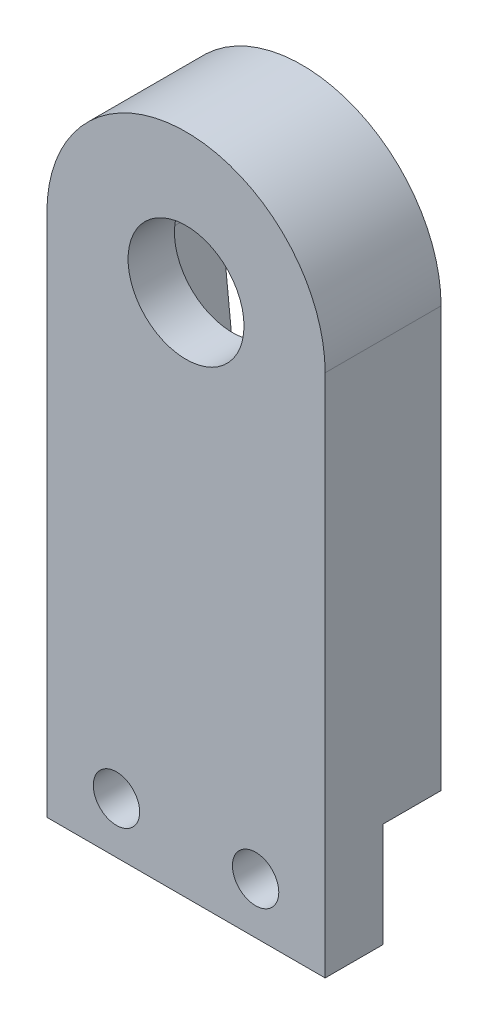
ISO-10303-21;
HEADER;
FILE_DESCRIPTION(('STEP AP214'),'2;1');
FILE_NAME('part.step','',(''),(''),'','','');
FILE_SCHEMA(('AUTOMOTIVE_DESIGN { 1 0 10303 214 1 1 1 1 }'));
ENDSEC;
DATA;
#1=APPLICATION_CONTEXT('core data for automotive mechanical design processes');
#2=APPLICATION_PROTOCOL_DEFINITION('international standard','automotive_design',2000,#1);
#3=PRODUCT_CONTEXT('',#1,'mechanical');
#4=PRODUCT('Part','Part','',(#3));
#5=PRODUCT_RELATED_PRODUCT_CATEGORY('part','',(#4));
#6=PRODUCT_DEFINITION_FORMATION('','',#4);
#7=PRODUCT_DEFINITION_CONTEXT('part definition',#1,'design');
#8=PRODUCT_DEFINITION('design','',#6,#7);
#9=PRODUCT_DEFINITION_SHAPE('','',#8);
#10=(LENGTH_UNIT() NAMED_UNIT(*) SI_UNIT(.MILLI.,.METRE.));
#11=(NAMED_UNIT(*) PLANE_ANGLE_UNIT() SI_UNIT($,.RADIAN.));
#12=(NAMED_UNIT(*) SI_UNIT($,.STERADIAN.) SOLID_ANGLE_UNIT());
#13=UNCERTAINTY_MEASURE_WITH_UNIT(LENGTH_MEASURE(1.E-05),#10,'distance_accuracy_value','');
#14=(GEOMETRIC_REPRESENTATION_CONTEXT(3) GLOBAL_UNCERTAINTY_ASSIGNED_CONTEXT((#13)) GLOBAL_UNIT_ASSIGNED_CONTEXT((#10,
#11,#12)) REPRESENTATION_CONTEXT('',''));
#15=CARTESIAN_POINT('',(0.,0.,0.));
#16=DIRECTION('',(0.,0.,1.));
#17=DIRECTION('',(1.,0.,0.));
#18=AXIS2_PLACEMENT_3D('',#15,#16,#17);
#19=CARTESIAN_POINT('',(0.,0.,0.));
#20=DIRECTION('',(0.,0.,1.));
#21=DIRECTION('',(1.,0.,0.));
#22=AXIS2_PLACEMENT_3D('',#19,#20,#21);
#23=PLANE('',#22);
#24=CARTESIAN_POINT('',(-37.4293830245733,302.993476390839,0.));
#25=DIRECTION('',(0.,0.,1.));
#26=DIRECTION('',(1.,0.,0.));
#27=AXIS2_PLACEMENT_3D('',#24,#25,#26);
#28=CIRCLE('',#27,3.6209952068518);
#29=CARTESIAN_POINT('',(-33.809082582593,303.064405918121,0.));
#30=VERTEX_POINT('',#29);
#31=CARTESIAN_POINT('',(-40.9619695672962,302.198216303687,0.));
#32=VERTEX_POINT('',#31);
#33=EDGE_CURVE('E57',#30,#32,#28,.T.);
#34=ORIENTED_EDGE('',*,*,#33,.T.);
#35=DIRECTION('',(0.102495598114495,-0.994733457950999,0.));
#36=VECTOR('',#35,1.);
#37=CARTESIAN_POINT('',(-40.9619695672962,302.198216303687,0.));
#38=LINE('',#37,#36);
#39=CARTESIAN_POINT('',(-39.5671986043453,288.661777973175,0.));
#40=VERTEX_POINT('',#39);
#41=EDGE_CURVE('E155',#32,#40,#38,.T.);
#42=ORIENTED_EDGE('',*,*,#41,.T.);
#43=CARTESIAN_POINT('',(-37.4293811619282,288.881826289682,0.));
#44=DIRECTION('',(0.,0.,-1.));
#45=DIRECTION('',(-1.,0.,0.));
#46=AXIS2_PLACEMENT_3D('',#43,#44,#45);
#47=CIRCLE('',#46,2.14911253281451);
#48=CARTESIAN_POINT('',(-35.291563719511,288.661777973175,0.));
#49=VERTEX_POINT('',#48);
#50=EDGE_CURVE('E158',#49,#40,#47,.T.);
#51=ORIENTED_EDGE('',*,*,#50,.F.);
#52=DIRECTION('',(-0.102390318397392,-0.99474430015883,0.));
#53=VECTOR('',#52,1.);
#54=CARTESIAN_POINT('',(-33.809082582593,303.064405918121,0.));
#55=LINE('',#54,#53);
#56=EDGE_CURVE('E145',#30,#49,#55,.T.);
#57=ORIENTED_EDGE('',*,*,#56,.F.);
#58=EDGE_LOOP('',(#34,#42,#51,#57));
#59=FACE_BOUND('',#58,.T.);
#60=DIRECTION('',(-1.,0.,0.));
#61=VECTOR('',#60,1.);
#62=CARTESIAN_POINT('',(-31.4293839037418,284.888430272738,0.));
#63=LINE('',#62,#61);
#64=CARTESIAN_POINT('',(-31.4293839037418,284.888430272738,0.));
#65=VERTEX_POINT('',#64);
#66=CARTESIAN_POINT('',(-43.4293821454048,284.888430272738,0.));
#67=VERTEX_POINT('',#66);
#68=EDGE_CURVE('E122',#65,#67,#63,.T.);
#69=ORIENTED_EDGE('',*,*,#68,.T.);
#70=DIRECTION('',(0.,-1.,0.));
#71=VECTOR('',#70,1.);
#72=CARTESIAN_POINT('',(-43.4293821454048,280.388430272738,0.));
#73=LINE('',#72,#71);
#74=CARTESIAN_POINT('',(-43.4293821454048,302.993476390839,0.));
#75=VERTEX_POINT('',#74);
#76=EDGE_CURVE('E184',#75,#67,#73,.T.);
#77=ORIENTED_EDGE('',*,*,#76,.F.);
#78=CARTESIAN_POINT('',(-37.4293830245733,302.993476390839,0.));
#79=DIRECTION('',(0.,0.,1.));
#80=DIRECTION('',(1.,0.,0.));
#81=AXIS2_PLACEMENT_3D('',#78,#79,#80);
#82=CIRCLE('',#81,5.99999912083149);
#83=CARTESIAN_POINT('',(-31.4293839037418,302.993476390839,0.));
#84=VERTEX_POINT('',#83);
#85=EDGE_CURVE('E174',#84,#75,#82,.T.);
#86=ORIENTED_EDGE('',*,*,#85,.F.);
#87=DIRECTION('',(0.,1.,0.));
#88=VECTOR('',#87,1.);
#89=CARTESIAN_POINT('',(-31.4293839037418,280.388430272738,0.));
#90=LINE('',#89,#88);
#91=EDGE_CURVE('E178',#65,#84,#90,.T.);
#92=ORIENTED_EDGE('',*,*,#91,.F.);
#93=EDGE_LOOP('',(#69,#77,#86,#92));
#94=FACE_BOUND('',#93,.T.);
#95=ADVANCED_FACE('F32',(#59,#94),#23,.F.);
#96=CARTESIAN_POINT('',(-31.4293839037418,280.388430272738,5.));
#97=DIRECTION('',(-1.,0.,0.));
#98=DIRECTION('',(0.,0.,1.));
#99=AXIS2_PLACEMENT_3D('',#96,#97,#98);
#100=PLANE('',#99);
#101=DIRECTION('',(0.,0.,-1.));
#102=VECTOR('',#101,1.);
#103=CARTESIAN_POINT('',(-31.4293839037418,284.888430272738,2.5));
#104=LINE('',#103,#102);
#105=CARTESIAN_POINT('',(-31.4293839037418,284.888430272738,2.5));
#106=VERTEX_POINT('',#105);
#107=EDGE_CURVE('E119',#106,#65,#104,.T.);
#108=ORIENTED_EDGE('',*,*,#107,.T.);
#109=ORIENTED_EDGE('',*,*,#91,.T.);
#110=DIRECTION('',(0.,0.,-1.));
#111=VECTOR('',#110,1.);
#112=CARTESIAN_POINT('',(-31.4293839037418,302.993476390839,5.));
#113=LINE('',#112,#111);
#114=CARTESIAN_POINT('',(-31.4293839037418,302.993476390839,5.));
#115=VERTEX_POINT('',#114);
#116=EDGE_CURVE('E11',#115,#84,#113,.T.);
#117=ORIENTED_EDGE('',*,*,#116,.F.);
#118=DIRECTION('',(0.,1.,0.));
#119=VECTOR('',#118,1.);
#120=CARTESIAN_POINT('',(-31.4293839037418,280.388430272738,5.));
#121=LINE('',#120,#119);
#122=CARTESIAN_POINT('',(-31.4293839037418,280.388430272738,5.));
#123=VERTEX_POINT('',#122);
#124=EDGE_CURVE('E181',#123,#115,#121,.T.);
#125=ORIENTED_EDGE('',*,*,#124,.F.);
#126=DIRECTION('',(0.,0.,-1.));
#127=VECTOR('',#126,1.);
#128=CARTESIAN_POINT('',(-31.4293839037418,280.388430272738,5.));
#129=LINE('',#128,#127);
#130=CARTESIAN_POINT('',(-31.4293839037418,280.388430272738,2.5));
#131=VERTEX_POINT('',#130);
#132=EDGE_CURVE('E130',#123,#131,#129,.T.);
#133=ORIENTED_EDGE('',*,*,#132,.T.);
#134=DIRECTION('',(0.,1.,0.));
#135=VECTOR('',#134,1.);
#136=CARTESIAN_POINT('',(-31.4293839037418,280.388430272738,2.5));
#137=LINE('',#136,#135);
#138=EDGE_CURVE('E49',#131,#106,#137,.T.);
#139=ORIENTED_EDGE('',*,*,#138,.T.);
#140=EDGE_LOOP('',(#108,#109,#117,#125,#133,#139));
#141=FACE_BOUND('',#140,.T.);
#142=ADVANCED_FACE('F34',(#141),#100,.F.);
#143=CARTESIAN_POINT('',(-43.4293821454048,280.388430272738,5.));
#144=DIRECTION('',(1.,0.,0.));
#145=DIRECTION('',(0.,0.,-1.));
#146=AXIS2_PLACEMENT_3D('',#143,#144,#145);
#147=PLANE('',#146);
#148=DIRECTION('',(0.,0.,-1.));
#149=VECTOR('',#148,1.);
#150=CARTESIAN_POINT('',(-43.4293821454048,284.888430272738,2.5));
#151=LINE('',#150,#149);
#152=CARTESIAN_POINT('',(-43.4293821454048,284.888430272738,2.5));
#153=VERTEX_POINT('',#152);
#154=EDGE_CURVE('E125',#153,#67,#151,.T.);
#155=ORIENTED_EDGE('',*,*,#154,.F.);
#156=DIRECTION('',(0.,1.,0.));
#157=VECTOR('',#156,1.);
#158=CARTESIAN_POINT('',(-43.4293821454048,280.388430272738,2.5));
#159=LINE('',#158,#157);
#160=CARTESIAN_POINT('',(-43.4293821454048,280.388430272738,2.5));
#161=VERTEX_POINT('',#160);
#162=EDGE_CURVE('E114',#161,#153,#159,.T.);
#163=ORIENTED_EDGE('',*,*,#162,.F.);
#164=DIRECTION('',(0.,0.,-1.));
#165=VECTOR('',#164,1.);
#166=CARTESIAN_POINT('',(-43.4293821454048,280.388430272738,5.));
#167=LINE('',#166,#165);
#168=CARTESIAN_POINT('',(-43.4293821454048,280.388430272738,5.));
#169=VERTEX_POINT('',#168);
#170=EDGE_CURVE('E192',#169,#161,#167,.T.);
#171=ORIENTED_EDGE('',*,*,#170,.F.);
#172=DIRECTION('',(0.,-1.,0.));
#173=VECTOR('',#172,1.);
#174=CARTESIAN_POINT('',(-43.4293821454048,280.388430272738,5.));
#175=LINE('',#174,#173);
#176=CARTESIAN_POINT('',(-43.4293821454048,302.993476390839,5.));
#177=VERTEX_POINT('',#176);
#178=EDGE_CURVE('E183',#177,#169,#175,.T.);
#179=ORIENTED_EDGE('',*,*,#178,.F.);
#180=DIRECTION('',(0.,0.,-1.));
#181=VECTOR('',#180,1.);
#182=CARTESIAN_POINT('',(-43.4293821454048,302.993476390839,5.));
#183=LINE('',#182,#181);
#184=EDGE_CURVE('E41',#177,#75,#183,.T.);
#185=ORIENTED_EDGE('',*,*,#184,.T.);
#186=ORIENTED_EDGE('',*,*,#76,.T.);
#187=EDGE_LOOP('',(#155,#163,#171,#179,#185,#186));
#188=FACE_BOUND('',#187,.T.);
#189=ADVANCED_FACE('F228',(#188),#147,.F.);
#190=CARTESIAN_POINT('',(-31.4293839037418,280.388430272738,5.));
#191=DIRECTION('',(0.,1.,0.));
#192=DIRECTION('',(0.,0.,1.));
#193=AXIS2_PLACEMENT_3D('',#190,#191,#192);
#194=PLANE('',#193);
#195=ORIENTED_EDGE('',*,*,#170,.T.);
#196=DIRECTION('',(-1.,0.,0.));
#197=VECTOR('',#196,1.);
#198=CARTESIAN_POINT('',(-31.4293839037418,280.388430272738,2.5));
#199=LINE('',#198,#197);
#200=EDGE_CURVE('E138',#131,#161,#199,.T.);
#201=ORIENTED_EDGE('',*,*,#200,.F.);
#202=ORIENTED_EDGE('',*,*,#132,.F.);
#203=DIRECTION('',(1.,0.,0.));
#204=VECTOR('',#203,1.);
#205=CARTESIAN_POINT('',(-31.4293839037418,280.388430272738,5.));
#206=LINE('',#205,#204);
#207=EDGE_CURVE('E186',#169,#123,#206,.T.);
#208=ORIENTED_EDGE('',*,*,#207,.F.);
#209=EDGE_LOOP('',(#195,#201,#202,#208));
#210=FACE_BOUND('',#209,.T.);
#211=ADVANCED_FACE('F216',(#210),#194,.F.);
#212=CARTESIAN_POINT('',(0.,0.,5.));
#213=DIRECTION('',(0.,0.,1.));
#214=DIRECTION('',(1.,0.,0.));
#215=AXIS2_PLACEMENT_3D('',#212,#213,#214);
#216=PLANE('',#215);
#217=CARTESIAN_POINT('',(-34.4293839037418,282.588430272738,5.));
#218=DIRECTION('',(0.,0.,1.));
#219=DIRECTION('',(1.,0.,0.));
#220=AXIS2_PLACEMENT_3D('',#217,#218,#219);
#221=CIRCLE('',#220,0.999999999999998);
#222=CARTESIAN_POINT('',(-33.4293839037418,282.588430272738,5.));
#223=VERTEX_POINT('',#222);
#224=EDGE_CURVE('E200',#223,#223,#221,.T.);
#225=ORIENTED_EDGE('',*,*,#224,.F.);
#226=EDGE_LOOP('',(#225));
#227=FACE_BOUND('',#226,.T.);
#228=CARTESIAN_POINT('',(-40.4293821454048,282.588430272738,5.));
#229=DIRECTION('',(0.,0.,1.));
#230=DIRECTION('',(1.,0.,0.));
#231=AXIS2_PLACEMENT_3D('',#228,#229,#230);
#232=CIRCLE('',#231,0.999999999999998);
#233=CARTESIAN_POINT('',(-39.4293821454048,282.588430272738,5.));
#234=VERTEX_POINT('',#233);
#235=EDGE_CURVE('E134',#234,#234,#232,.T.);
#236=ORIENTED_EDGE('',*,*,#235,.F.);
#237=EDGE_LOOP('',(#236));
#238=FACE_BOUND('',#237,.T.);
#239=CARTESIAN_POINT('',(-37.4293830245733,302.993476390839,5.));
#240=DIRECTION('',(0.,0.,1.));
#241=DIRECTION('',(1.,0.,0.));
#242=AXIS2_PLACEMENT_3D('',#239,#240,#241);
#243=CIRCLE('',#242,2.5);
#244=CARTESIAN_POINT('',(-34.9293830245733,302.993476390839,5.));
#245=VERTEX_POINT('',#244);
#246=EDGE_CURVE('E171',#245,#245,#243,.T.);
#247=ORIENTED_EDGE('',*,*,#246,.F.);
#248=EDGE_LOOP('',(#247));
#249=FACE_BOUND('',#248,.T.);
#250=ORIENTED_EDGE('',*,*,#124,.T.);
#251=CARTESIAN_POINT('',(-37.4293830245733,302.993476390839,5.));
#252=DIRECTION('',(0.,0.,1.));
#253=DIRECTION('',(1.,0.,0.));
#254=AXIS2_PLACEMENT_3D('',#251,#252,#253);
#255=CIRCLE('',#254,5.99999912083149);
#256=EDGE_CURVE('E175',#115,#177,#255,.T.);
#257=ORIENTED_EDGE('',*,*,#256,.T.);
#258=ORIENTED_EDGE('',*,*,#178,.T.);
#259=ORIENTED_EDGE('',*,*,#207,.T.);
#260=EDGE_LOOP('',(#250,#257,#258,#259));
#261=FACE_BOUND('',#260,.T.);
#262=ADVANCED_FACE('F212',(#227,#238,#249,#261),#216,.T.);
#263=CARTESIAN_POINT('',(-37.4293830245733,302.993476390839,5.));
#264=DIRECTION('',(0.,0.,-1.));
#265=DIRECTION('',(-1.,0.,0.));
#266=AXIS2_PLACEMENT_3D('',#263,#264,#265);
#267=CYLINDRICAL_SURFACE('',#266,5.99999912083149);
#268=ORIENTED_EDGE('',*,*,#85,.T.);
#269=ORIENTED_EDGE('',*,*,#184,.F.);
#270=ORIENTED_EDGE('',*,*,#256,.F.);
#271=ORIENTED_EDGE('',*,*,#116,.T.);
#272=EDGE_LOOP('',(#268,#269,#270,#271));
#273=FACE_BOUND('',#272,.T.);
#274=ADVANCED_FACE('F215',(#273),#267,.T.);
#275=CARTESIAN_POINT('',(-37.4293830245733,302.993476390839,5.));
#276=DIRECTION('',(0.,0.,-1.));
#277=DIRECTION('',(-1.,0.,0.));
#278=AXIS2_PLACEMENT_3D('',#275,#276,#277);
#279=CYLINDRICAL_SURFACE('',#278,2.5);
#280=CARTESIAN_POINT('',(-37.4293830245733,302.993476390839,3.));
#281=DIRECTION('',(0.,0.,1.));
#282=DIRECTION('',(1.,0.,0.));
#283=AXIS2_PLACEMENT_3D('',#280,#281,#282);
#284=CIRCLE('',#283,2.5);
#285=CARTESIAN_POINT('',(-34.9293830245733,302.993476390839,3.));
#286=VERTEX_POINT('',#285);
#287=EDGE_CURVE('E170',#286,#286,#284,.T.);
#288=ORIENTED_EDGE('',*,*,#287,.F.);
#289=EDGE_LOOP('',(#288));
#290=FACE_BOUND('',#289,.T.);
#291=ORIENTED_EDGE('',*,*,#246,.T.);
#292=EDGE_LOOP('',(#291));
#293=FACE_BOUND('',#292,.T.);
#294=ADVANCED_FACE('F246',(#290,#293),#279,.F.);
#295=CARTESIAN_POINT('',(-37.4293830245733,302.993476390839,3.));
#296=DIRECTION('',(0.,0.,-1.));
#297=DIRECTION('',(-1.,0.,0.));
#298=AXIS2_PLACEMENT_3D('',#295,#296,#297);
#299=CYLINDRICAL_SURFACE('',#298,3.6209952068518);
#300=ORIENTED_EDGE('',*,*,#33,.F.);
#301=DIRECTION('',(0.,0.,-1.));
#302=VECTOR('',#301,1.);
#303=CARTESIAN_POINT('',(-33.809082582593,303.064405918121,3.));
#304=LINE('',#303,#302);
#305=CARTESIAN_POINT('',(-33.809082582593,303.064405918121,3.));
#306=VERTEX_POINT('',#305);
#307=EDGE_CURVE('E153',#306,#30,#304,.T.);
#308=ORIENTED_EDGE('',*,*,#307,.F.);
#309=CARTESIAN_POINT('',(-37.4293830245733,302.993476390839,3.));
#310=DIRECTION('',(0.,0.,1.));
#311=DIRECTION('',(1.,0.,0.));
#312=AXIS2_PLACEMENT_3D('',#309,#310,#311);
#313=CIRCLE('',#312,3.6209952068518);
#314=CARTESIAN_POINT('',(-40.9619695672962,302.198216303687,3.));
#315=VERTEX_POINT('',#314);
#316=EDGE_CURVE('E141',#306,#315,#313,.T.);
#317=ORIENTED_EDGE('',*,*,#316,.T.);
#318=DIRECTION('',(0.,0.,-1.));
#319=VECTOR('',#318,1.);
#320=CARTESIAN_POINT('',(-40.9619695672962,302.198216303687,3.));
#321=LINE('',#320,#319);
#322=EDGE_CURVE('E168',#315,#32,#321,.T.);
#323=ORIENTED_EDGE('',*,*,#322,.T.);
#324=EDGE_LOOP('',(#300,#308,#317,#323));
#325=FACE_BOUND('',#324,.T.);
#326=ADVANCED_FACE('F249',(#325),#299,.F.);
#327=CARTESIAN_POINT('',(-40.9619695672962,302.198216303687,3.));
#328=DIRECTION('',(0.994733457950999,0.102495598114495,0.));
#329=DIRECTION('',(-0.102495598114495,0.994733457950999,0.));
#330=AXIS2_PLACEMENT_3D('',#327,#328,#329);
#331=PLANE('',#330);
#332=ORIENTED_EDGE('',*,*,#41,.F.);
#333=ORIENTED_EDGE('',*,*,#322,.F.);
#334=DIRECTION('',(0.102495598114495,-0.994733457950999,0.));
#335=VECTOR('',#334,1.);
#336=CARTESIAN_POINT('',(-40.9619695672962,302.198216303687,3.));
#337=LINE('',#336,#335);
#338=CARTESIAN_POINT('',(-39.5671986043453,288.661777973175,3.));
#339=VERTEX_POINT('',#338);
#340=EDGE_CURVE('E144',#315,#339,#337,.T.);
#341=ORIENTED_EDGE('',*,*,#340,.T.);
#342=DIRECTION('',(0.,0.,-1.));
#343=VECTOR('',#342,1.);
#344=CARTESIAN_POINT('',(-39.5671986043453,288.661777973175,3.));
#345=LINE('',#344,#343);
#346=EDGE_CURVE('E166',#339,#40,#345,.T.);
#347=ORIENTED_EDGE('',*,*,#346,.T.);
#348=EDGE_LOOP('',(#332,#333,#341,#347));
#349=FACE_BOUND('',#348,.T.);
#350=ADVANCED_FACE('F253',(#349),#331,.T.);
#351=CARTESIAN_POINT('',(-37.4293811619282,288.881826289682,3.));
#352=DIRECTION('',(0.,0.,-1.));
#353=DIRECTION('',(-1.,0.,0.));
#354=AXIS2_PLACEMENT_3D('',#351,#352,#353);
#355=CYLINDRICAL_SURFACE('',#354,2.14911253281451);
#356=ORIENTED_EDGE('',*,*,#50,.T.);
#357=ORIENTED_EDGE('',*,*,#346,.F.);
#358=CARTESIAN_POINT('',(-37.4293811619282,288.881826289682,3.));
#359=DIRECTION('',(0.,0.,-1.));
#360=DIRECTION('',(-1.,0.,0.));
#361=AXIS2_PLACEMENT_3D('',#358,#359,#360);
#362=CIRCLE('',#361,2.14911253281451);
#363=CARTESIAN_POINT('',(-35.291563719511,288.661777973175,3.));
#364=VERTEX_POINT('',#363);
#365=EDGE_CURVE('E147',#364,#339,#362,.T.);
#366=ORIENTED_EDGE('',*,*,#365,.F.);
#367=DIRECTION('',(0.,0.,-1.));
#368=VECTOR('',#367,1.);
#369=CARTESIAN_POINT('',(-35.291563719511,288.661777973175,3.));
#370=LINE('',#369,#368);
#371=EDGE_CURVE('E164',#364,#49,#370,.T.);
#372=ORIENTED_EDGE('',*,*,#371,.T.);
#373=EDGE_LOOP('',(#356,#357,#366,#372));
#374=FACE_BOUND('',#373,.T.);
#375=ADVANCED_FACE('F256',(#374),#355,.F.);
#376=CARTESIAN_POINT('',(-33.809082582593,303.064405918121,3.));
#377=DIRECTION('',(0.99474430015883,-0.102390318397392,0.));
#378=DIRECTION('',(0.102390318397392,0.99474430015883,0.));
#379=AXIS2_PLACEMENT_3D('',#376,#377,#378);
#380=PLANE('',#379);
#381=ORIENTED_EDGE('',*,*,#56,.T.);
#382=ORIENTED_EDGE('',*,*,#371,.F.);
#383=DIRECTION('',(-0.102390318397392,-0.99474430015883,0.));
#384=VECTOR('',#383,1.);
#385=CARTESIAN_POINT('',(-33.809082582593,303.064405918121,3.));
#386=LINE('',#385,#384);
#387=EDGE_CURVE('E150',#306,#364,#386,.T.);
#388=ORIENTED_EDGE('',*,*,#387,.F.);
#389=ORIENTED_EDGE('',*,*,#307,.T.);
#390=EDGE_LOOP('',(#381,#382,#388,#389));
#391=FACE_BOUND('',#390,.T.);
#392=ADVANCED_FACE('F260',(#391),#380,.F.);
#393=CARTESIAN_POINT('',(-37.4293830245733,302.993476390839,3.));
#394=DIRECTION('',(0.,0.,1.));
#395=DIRECTION('',(1.,0.,0.));
#396=AXIS2_PLACEMENT_3D('',#393,#394,#395);
#397=PLANE('',#396);
#398=ORIENTED_EDGE('',*,*,#287,.T.);
#399=EDGE_LOOP('',(#398));
#400=FACE_BOUND('',#399,.T.);
#401=ORIENTED_EDGE('',*,*,#316,.F.);
#402=ORIENTED_EDGE('',*,*,#387,.T.);
#403=ORIENTED_EDGE('',*,*,#365,.T.);
#404=ORIENTED_EDGE('',*,*,#340,.F.);
#405=EDGE_LOOP('',(#401,#402,#403,#404));
#406=FACE_BOUND('',#405,.T.);
#407=ADVANCED_FACE('F264',(#400,#406),#397,.F.);
#408=CARTESIAN_POINT('',(-31.4293839037418,284.888430272738,2.5));
#409=DIRECTION('',(0.,-1.,0.));
#410=DIRECTION('',(0.,0.,-1.));
#411=AXIS2_PLACEMENT_3D('',#408,#409,#410);
#412=PLANE('',#411);
#413=ORIENTED_EDGE('',*,*,#68,.F.);
#414=ORIENTED_EDGE('',*,*,#107,.F.);
#415=DIRECTION('',(-1.,0.,0.));
#416=VECTOR('',#415,1.);
#417=CARTESIAN_POINT('',(-31.4293839037418,284.888430272738,2.5));
#418=LINE('',#417,#416);
#419=EDGE_CURVE('E110',#106,#153,#418,.T.);
#420=ORIENTED_EDGE('',*,*,#419,.T.);
#421=ORIENTED_EDGE('',*,*,#154,.T.);
#422=EDGE_LOOP('',(#413,#414,#420,#421));
#423=FACE_BOUND('',#422,.T.);
#424=ADVANCED_FACE('F120',(#423),#412,.T.);
#425=CARTESIAN_POINT('',(0.,0.,2.5));
#426=DIRECTION('',(0.,0.,1.));
#427=DIRECTION('',(1.,0.,0.));
#428=AXIS2_PLACEMENT_3D('',#425,#426,#427);
#429=PLANE('',#428);
#430=CARTESIAN_POINT('',(-34.4293839037418,282.588430272738,2.5));
#431=DIRECTION('',(0.,0.,1.));
#432=DIRECTION('',(1.,0.,0.));
#433=AXIS2_PLACEMENT_3D('',#430,#431,#432);
#434=CIRCLE('',#433,0.999999999999998);
#435=CARTESIAN_POINT('',(-33.4293839037418,282.588430272738,2.5));
#436=VERTEX_POINT('',#435);
#437=EDGE_CURVE('E36',#436,#436,#434,.F.);
#438=ORIENTED_EDGE('',*,*,#437,.F.);
#439=EDGE_LOOP('',(#438));
#440=FACE_BOUND('',#439,.T.);
#441=CARTESIAN_POINT('',(-40.4293821454048,282.588430272738,2.5));
#442=DIRECTION('',(0.,0.,1.));
#443=DIRECTION('',(1.,0.,0.));
#444=AXIS2_PLACEMENT_3D('',#441,#442,#443);
#445=CIRCLE('',#444,0.999999999999998);
#446=CARTESIAN_POINT('',(-39.4293821454048,282.588430272738,2.5));
#447=VERTEX_POINT('',#446);
#448=EDGE_CURVE('E198',#447,#447,#445,.F.);
#449=ORIENTED_EDGE('',*,*,#448,.F.);
#450=EDGE_LOOP('',(#449));
#451=FACE_BOUND('',#450,.T.);
#452=ORIENTED_EDGE('',*,*,#138,.F.);
#453=ORIENTED_EDGE('',*,*,#200,.T.);
#454=ORIENTED_EDGE('',*,*,#162,.T.);
#455=ORIENTED_EDGE('',*,*,#419,.F.);
#456=EDGE_LOOP('',(#452,#453,#454,#455));
#457=FACE_BOUND('',#456,.T.);
#458=ADVANCED_FACE('F112',(#440,#451,#457),#429,.F.);
#459=CARTESIAN_POINT('',(-40.4293821454048,282.588430272738,5.));
#460=DIRECTION('',(0.,0.,-1.));
#461=DIRECTION('',(-1.,0.,0.));
#462=AXIS2_PLACEMENT_3D('',#459,#460,#461);
#463=CYLINDRICAL_SURFACE('',#462,0.999999999999998);
#464=ORIENTED_EDGE('',*,*,#235,.T.);
#465=EDGE_LOOP('',(#464));
#466=FACE_BOUND('',#465,.T.);
#467=ORIENTED_EDGE('',*,*,#448,.T.);
#468=EDGE_LOOP('',(#467));
#469=FACE_BOUND('',#468,.T.);
#470=ADVANCED_FACE('F210',(#466,#469),#463,.F.);
#471=CARTESIAN_POINT('',(-34.4293839037418,282.588430272738,5.));
#472=DIRECTION('',(0.,0.,-1.));
#473=DIRECTION('',(-1.,0.,0.));
#474=AXIS2_PLACEMENT_3D('',#471,#472,#473);
#475=CYLINDRICAL_SURFACE('',#474,0.999999999999998);
#476=ORIENTED_EDGE('',*,*,#224,.T.);
#477=EDGE_LOOP('',(#476));
#478=FACE_BOUND('',#477,.T.);
#479=ORIENTED_EDGE('',*,*,#437,.T.);
#480=EDGE_LOOP('',(#479));
#481=FACE_BOUND('',#480,.T.);
#482=ADVANCED_FACE('F276',(#478,#481),#475,.F.);
#483=CLOSED_SHELL('',(#95,#142,#189,#211,#262,#274,#294,#326,#350,#375,#392,#407,#424,#458,#470,#482));
#484=MANIFOLD_SOLID_BREP('B2',#483);
#485=ADVANCED_BREP_SHAPE_REPRESENTATION('',(#18,#484),#14);
#486=SHAPE_DEFINITION_REPRESENTATION(#9,#485);
ENDSEC;
END-ISO-10303-21;
